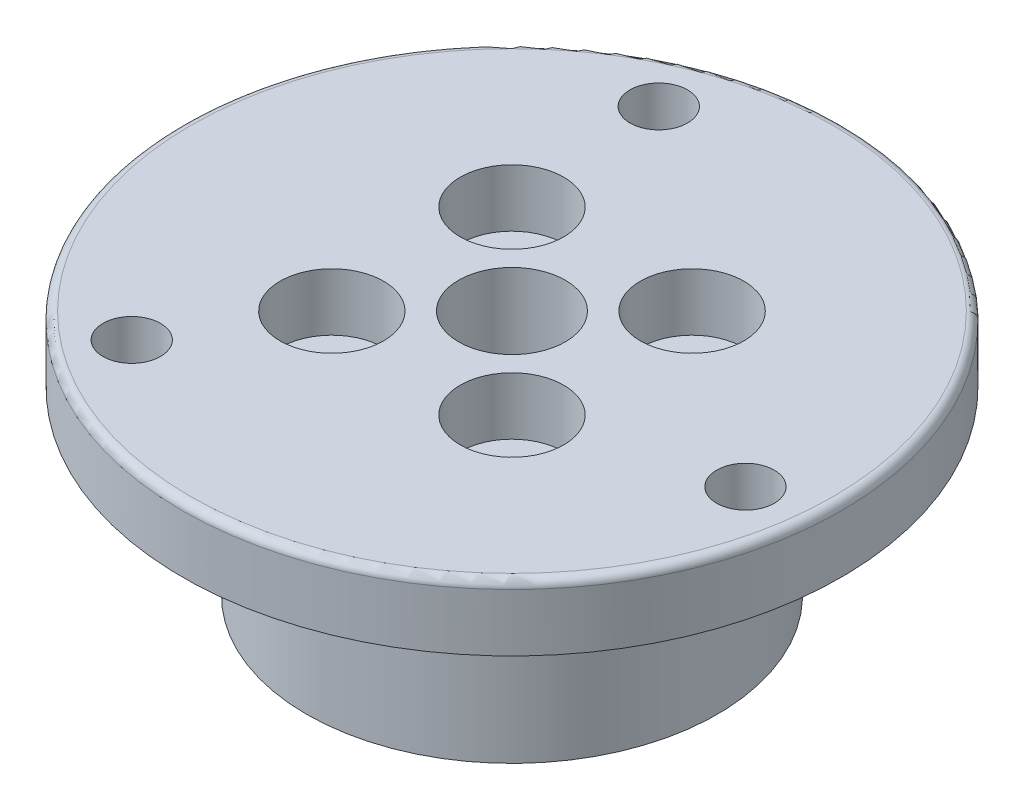
ISO-10303-21;
HEADER;
FILE_DESCRIPTION(('STEP AP214'),'2;1');
FILE_NAME('part.step','',(''),(''),'','','');
FILE_SCHEMA(('AUTOMOTIVE_DESIGN { 1 0 10303 214 1 1 1 1 }'));
ENDSEC;
DATA;
#1=APPLICATION_CONTEXT('core data for automotive mechanical design processes');
#2=APPLICATION_PROTOCOL_DEFINITION('international standard','automotive_design',2000,#1);
#3=PRODUCT_CONTEXT('',#1,'mechanical');
#4=PRODUCT('Part','Part','',(#3));
#5=PRODUCT_RELATED_PRODUCT_CATEGORY('part','',(#4));
#6=PRODUCT_DEFINITION_FORMATION('','',#4);
#7=PRODUCT_DEFINITION_CONTEXT('part definition',#1,'design');
#8=PRODUCT_DEFINITION('design','',#6,#7);
#9=PRODUCT_DEFINITION_SHAPE('','',#8);
#10=(LENGTH_UNIT() NAMED_UNIT(*) SI_UNIT(.MILLI.,.METRE.));
#11=(NAMED_UNIT(*) PLANE_ANGLE_UNIT() SI_UNIT($,.RADIAN.));
#12=(NAMED_UNIT(*) SI_UNIT($,.STERADIAN.) SOLID_ANGLE_UNIT());
#13=UNCERTAINTY_MEASURE_WITH_UNIT(LENGTH_MEASURE(1.E-05),#10,'distance_accuracy_value','');
#14=(GEOMETRIC_REPRESENTATION_CONTEXT(3) GLOBAL_UNCERTAINTY_ASSIGNED_CONTEXT((#13)) GLOBAL_UNIT_ASSIGNED_CONTEXT((#10,
#11,#12)) REPRESENTATION_CONTEXT('',''));
#15=CARTESIAN_POINT('',(0.,0.,0.));
#16=DIRECTION('',(0.,0.,1.));
#17=DIRECTION('',(1.,0.,0.));
#18=AXIS2_PLACEMENT_3D('',#15,#16,#17);
#19=CARTESIAN_POINT('',(16.3588402126679,15.,2.15368217163084));
#20=DIRECTION('',(0.,-1.,0.));
#21=DIRECTION('',(0.,0.,-1.));
#22=AXIS2_PLACEMENT_3D('',#19,#20,#21);
#23=CYLINDRICAL_SURFACE('',#22,1.75);
#24=CARTESIAN_POINT('',(16.3588402126679,15.,2.15368217163084));
#25=DIRECTION('',(0.,1.,0.));
#26=DIRECTION('',(0.,0.,1.));
#27=AXIS2_PLACEMENT_3D('',#24,#25,#26);
#28=CIRCLE('',#27,1.75);
#29=CARTESIAN_POINT('',(16.3588402126679,15.,3.90368217163084));
#30=VERTEX_POINT('',#29);
#31=EDGE_CURVE('E58',#30,#30,#28,.T.);
#32=ORIENTED_EDGE('',*,*,#31,.T.);
#33=EDGE_LOOP('',(#32));
#34=FACE_BOUND('',#33,.T.);
#35=CARTESIAN_POINT('',(16.3588402126679,11.,2.15368217163084));
#36=DIRECTION('',(0.,-1.,0.));
#37=DIRECTION('',(0.,0.,-1.));
#38=AXIS2_PLACEMENT_3D('',#35,#36,#37);
#39=CIRCLE('',#38,1.75);
#40=CARTESIAN_POINT('',(16.3588402126679,11.,0.403682171630836));
#41=VERTEX_POINT('',#40);
#42=EDGE_CURVE('E111',#41,#41,#39,.T.);
#43=ORIENTED_EDGE('',*,*,#42,.T.);
#44=EDGE_LOOP('',(#43));
#45=FACE_BOUND('',#44,.T.);
#46=ADVANCED_FACE('F47',(#34,#45),#23,.F.);
#47=CARTESIAN_POINT('',(-6.314276634024,15.,-15.2440122864362));
#48=DIRECTION('',(0.,-1.,0.));
#49=DIRECTION('',(0.,0.,-1.));
#50=AXIS2_PLACEMENT_3D('',#47,#48,#49);
#51=CYLINDRICAL_SURFACE('',#50,1.75);
#52=CARTESIAN_POINT('',(-6.314276634024,15.,-15.2440122864362));
#53=DIRECTION('',(0.,1.,0.));
#54=DIRECTION('',(0.,0.,1.));
#55=AXIS2_PLACEMENT_3D('',#52,#53,#54);
#56=CIRCLE('',#55,1.75);
#57=CARTESIAN_POINT('',(-6.314276634024,15.,-13.4940122864362));
#58=VERTEX_POINT('',#57);
#59=EDGE_CURVE('E62',#58,#58,#56,.T.);
#60=ORIENTED_EDGE('',*,*,#59,.T.);
#61=EDGE_LOOP('',(#60));
#62=FACE_BOUND('',#61,.T.);
#63=CARTESIAN_POINT('',(-6.314276634024,11.,-15.2440122864362));
#64=DIRECTION('',(0.,-1.,0.));
#65=DIRECTION('',(0.,0.,-1.));
#66=AXIS2_PLACEMENT_3D('',#63,#64,#65);
#67=CIRCLE('',#66,1.75);
#68=CARTESIAN_POINT('',(-6.314276634024,11.,-16.9940122864362));
#69=VERTEX_POINT('',#68);
#70=EDGE_CURVE('E127',#69,#69,#67,.T.);
#71=ORIENTED_EDGE('',*,*,#70,.T.);
#72=EDGE_LOOP('',(#71));
#73=FACE_BOUND('',#72,.T.);
#74=ADVANCED_FACE('F166',(#62,#73),#51,.F.);
#75=CARTESIAN_POINT('',(-10.0445635786439,15.,13.0903301148054));
#76=DIRECTION('',(0.,-1.,0.));
#77=DIRECTION('',(0.,0.,-1.));
#78=AXIS2_PLACEMENT_3D('',#75,#76,#77);
#79=CYLINDRICAL_SURFACE('',#78,1.75);
#80=CARTESIAN_POINT('',(-10.0445635786439,15.,13.0903301148054));
#81=DIRECTION('',(0.,1.,0.));
#82=DIRECTION('',(0.,0.,1.));
#83=AXIS2_PLACEMENT_3D('',#80,#81,#82);
#84=CIRCLE('',#83,1.75);
#85=CARTESIAN_POINT('',(-10.0445635786439,15.,14.8403301148054));
#86=VERTEX_POINT('',#85);
#87=EDGE_CURVE('E96',#86,#86,#84,.T.);
#88=ORIENTED_EDGE('',*,*,#87,.T.);
#89=EDGE_LOOP('',(#88));
#90=FACE_BOUND('',#89,.T.);
#91=CARTESIAN_POINT('',(-10.0445635786439,11.,13.0903301148054));
#92=DIRECTION('',(0.,-1.,0.));
#93=DIRECTION('',(0.,0.,-1.));
#94=AXIS2_PLACEMENT_3D('',#91,#92,#93);
#95=CIRCLE('',#94,1.75);
#96=CARTESIAN_POINT('',(-10.0445635786439,11.,11.3403301148054));
#97=VERTEX_POINT('',#96);
#98=EDGE_CURVE('E130',#97,#97,#95,.T.);
#99=ORIENTED_EDGE('',*,*,#98,.T.);
#100=EDGE_LOOP('',(#99));
#101=FACE_BOUND('',#100,.T.);
#102=ADVANCED_FACE('F157',(#90,#101),#79,.F.);
#103=CARTESIAN_POINT('',(0.,15.,0.));
#104=DIRECTION('',(0.,-1.,0.));
#105=DIRECTION('',(0.,0.,-1.));
#106=AXIS2_PLACEMENT_3D('',#103,#104,#105);
#107=CYLINDRICAL_SURFACE('',#106,20.05);
#108=CARTESIAN_POINT('',(0.,14.5,0.));
#109=DIRECTION('',(0.,1.,0.));
#110=DIRECTION('',(0.,0.,1.));
#111=AXIS2_PLACEMENT_3D('',#108,#109,#110);
#112=CIRCLE('',#111,20.05);
#113=CARTESIAN_POINT('',(0.,14.5,20.05));
#114=VERTEX_POINT('',#113);
#115=EDGE_CURVE('E12',#114,#114,#112,.F.);
#116=ORIENTED_EDGE('',*,*,#115,.T.);
#117=EDGE_LOOP('',(#116));
#118=FACE_BOUND('',#117,.T.);
#119=CARTESIAN_POINT('',(0.,11.,0.));
#120=DIRECTION('',(0.,-1.,0.));
#121=DIRECTION('',(0.,0.,-1.));
#122=AXIS2_PLACEMENT_3D('',#119,#120,#121);
#123=CIRCLE('',#122,20.05);
#124=CARTESIAN_POINT('',(0.,11.,-20.05));
#125=VERTEX_POINT('',#124);
#126=EDGE_CURVE('E133',#125,#125,#123,.T.);
#127=ORIENTED_EDGE('',*,*,#126,.F.);
#128=EDGE_LOOP('',(#127));
#129=FACE_BOUND('',#128,.T.);
#130=ADVANCED_FACE('F154',(#118,#129),#107,.T.);
#131=CARTESIAN_POINT('',(0.,0.,0.));
#132=DIRECTION('',(0.,1.,0.));
#133=DIRECTION('',(0.,0.,1.));
#134=AXIS2_PLACEMENT_3D('',#131,#132,#133);
#135=PLANE('',#134);
#136=CARTESIAN_POINT('',(-5.48007755419575,0.,-5.48007755419574));
#137=DIRECTION('',(0.,1.,0.));
#138=DIRECTION('',(0.,0.,1.));
#139=AXIS2_PLACEMENT_3D('',#136,#137,#138);
#140=CIRCLE('',#139,1.75);
#141=CARTESIAN_POINT('',(-5.48007755419575,0.,-3.73007755419574));
#142=VERTEX_POINT('',#141);
#143=EDGE_CURVE('E79',#142,#142,#140,.T.);
#144=ORIENTED_EDGE('',*,*,#143,.T.);
#145=EDGE_LOOP('',(#144));
#146=FACE_BOUND('',#145,.T.);
#147=CARTESIAN_POINT('',(-5.48007755419574,0.,5.48007755419574));
#148=DIRECTION('',(0.,1.,0.));
#149=DIRECTION('',(0.,0.,1.));
#150=AXIS2_PLACEMENT_3D('',#147,#148,#149);
#151=CIRCLE('',#150,1.75);
#152=CARTESIAN_POINT('',(-5.48007755419574,0.,7.23007755419574));
#153=VERTEX_POINT('',#152);
#154=EDGE_CURVE('E83',#153,#153,#151,.T.);
#155=ORIENTED_EDGE('',*,*,#154,.T.);
#156=EDGE_LOOP('',(#155));
#157=FACE_BOUND('',#156,.T.);
#158=CARTESIAN_POINT('',(5.48007755419575,0.,5.48007755419575));
#159=DIRECTION('',(0.,1.,0.));
#160=DIRECTION('',(0.,0.,1.));
#161=AXIS2_PLACEMENT_3D('',#158,#159,#160);
#162=CIRCLE('',#161,1.75);
#163=CARTESIAN_POINT('',(5.48007755419575,0.,7.23007755419575));
#164=VERTEX_POINT('',#163);
#165=EDGE_CURVE('E86',#164,#164,#162,.T.);
#166=ORIENTED_EDGE('',*,*,#165,.T.);
#167=EDGE_LOOP('',(#166));
#168=FACE_BOUND('',#167,.T.);
#169=CARTESIAN_POINT('',(5.48007755419575,0.,-5.48007755419574));
#170=DIRECTION('',(0.,1.,0.));
#171=DIRECTION('',(0.,0.,1.));
#172=AXIS2_PLACEMENT_3D('',#169,#170,#171);
#173=CIRCLE('',#172,1.75);
#174=CARTESIAN_POINT('',(5.48007755419575,0.,-3.73007755419574));
#175=VERTEX_POINT('',#174);
#176=EDGE_CURVE('E89',#175,#175,#173,.T.);
#177=ORIENTED_EDGE('',*,*,#176,.T.);
#178=EDGE_LOOP('',(#177));
#179=FACE_BOUND('',#178,.T.);
#180=CARTESIAN_POINT('',(0.,0.,0.));
#181=DIRECTION('',(0.,1.,0.));
#182=DIRECTION('',(0.,0.,1.));
#183=AXIS2_PLACEMENT_3D('',#180,#181,#182);
#184=CIRCLE('',#183,3.25);
#185=CARTESIAN_POINT('',(0.,0.,3.25));
#186=VERTEX_POINT('',#185);
#187=EDGE_CURVE('E68',#186,#186,#184,.T.);
#188=ORIENTED_EDGE('',*,*,#187,.T.);
#189=EDGE_LOOP('',(#188));
#190=FACE_BOUND('',#189,.T.);
#191=CARTESIAN_POINT('',(0.,0.,0.));
#192=DIRECTION('',(0.,-1.,0.));
#193=DIRECTION('',(0.,0.,-1.));
#194=AXIS2_PLACEMENT_3D('',#191,#192,#193);
#195=CIRCLE('',#194,12.5);
#196=CARTESIAN_POINT('',(0.,0.,-12.5));
#197=VERTEX_POINT('',#196);
#198=EDGE_CURVE('E137',#197,#197,#195,.T.);
#199=ORIENTED_EDGE('',*,*,#198,.T.);
#200=EDGE_LOOP('',(#199));
#201=FACE_BOUND('',#200,.T.);
#202=ADVANCED_FACE('F156',(#146,#157,#168,#179,#190,#201),#135,.F.);
#203=CARTESIAN_POINT('',(-5.48007755419575,15.,-5.48007755419574));
#204=DIRECTION('',(0.,-1.,0.));
#205=DIRECTION('',(0.,0.,-1.));
#206=AXIS2_PLACEMENT_3D('',#203,#204,#205);
#207=CYLINDRICAL_SURFACE('',#206,1.75);
#208=ORIENTED_EDGE('',*,*,#143,.F.);
#209=EDGE_LOOP('',(#208));
#210=FACE_BOUND('',#209,.T.);
#211=CARTESIAN_POINT('',(-5.48007755419575,11.5,-5.48007755419574));
#212=DIRECTION('',(0.,1.,0.));
#213=DIRECTION('',(0.,0.,1.));
#214=AXIS2_PLACEMENT_3D('',#211,#212,#213);
#215=CIRCLE('',#214,1.75);
#216=CARTESIAN_POINT('',(-5.48007755419575,11.5,-3.73007755419574));
#217=VERTEX_POINT('',#216);
#218=EDGE_CURVE('E65',#217,#217,#215,.T.);
#219=ORIENTED_EDGE('',*,*,#218,.T.);
#220=EDGE_LOOP('',(#219));
#221=FACE_BOUND('',#220,.T.);
#222=ADVANCED_FACE('F163',(#210,#221),#207,.F.);
#223=CARTESIAN_POINT('',(-5.48007755419574,15.,5.48007755419574));
#224=DIRECTION('',(0.,-1.,0.));
#225=DIRECTION('',(0.,0.,-1.));
#226=AXIS2_PLACEMENT_3D('',#223,#224,#225);
#227=CYLINDRICAL_SURFACE('',#226,1.75);
#228=ORIENTED_EDGE('',*,*,#154,.F.);
#229=EDGE_LOOP('',(#228));
#230=FACE_BOUND('',#229,.T.);
#231=CARTESIAN_POINT('',(-5.48007755419574,11.5,5.48007755419574));
#232=DIRECTION('',(0.,1.,0.));
#233=DIRECTION('',(0.,0.,1.));
#234=AXIS2_PLACEMENT_3D('',#231,#232,#233);
#235=CIRCLE('',#234,1.75);
#236=CARTESIAN_POINT('',(-5.48007755419574,11.5,7.23007755419574));
#237=VERTEX_POINT('',#236);
#238=EDGE_CURVE('E69',#237,#237,#235,.T.);
#239=ORIENTED_EDGE('',*,*,#238,.T.);
#240=EDGE_LOOP('',(#239));
#241=FACE_BOUND('',#240,.T.);
#242=ADVANCED_FACE('F181',(#230,#241),#227,.F.);
#243=CARTESIAN_POINT('',(5.48007755419575,15.,5.48007755419575));
#244=DIRECTION('',(0.,-1.,0.));
#245=DIRECTION('',(0.,0.,-1.));
#246=AXIS2_PLACEMENT_3D('',#243,#244,#245);
#247=CYLINDRICAL_SURFACE('',#246,1.75);
#248=ORIENTED_EDGE('',*,*,#165,.F.);
#249=EDGE_LOOP('',(#248));
#250=FACE_BOUND('',#249,.T.);
#251=CARTESIAN_POINT('',(5.48007755419575,11.5,5.48007755419575));
#252=DIRECTION('',(0.,1.,0.));
#253=DIRECTION('',(0.,0.,1.));
#254=AXIS2_PLACEMENT_3D('',#251,#252,#253);
#255=CIRCLE('',#254,1.75);
#256=CARTESIAN_POINT('',(5.48007755419575,11.5,7.23007755419575));
#257=VERTEX_POINT('',#256);
#258=EDGE_CURVE('E72',#257,#257,#255,.T.);
#259=ORIENTED_EDGE('',*,*,#258,.T.);
#260=EDGE_LOOP('',(#259));
#261=FACE_BOUND('',#260,.T.);
#262=ADVANCED_FACE('F185',(#250,#261),#247,.F.);
#263=CARTESIAN_POINT('',(5.48007755419575,15.,-5.48007755419574));
#264=DIRECTION('',(0.,-1.,0.));
#265=DIRECTION('',(0.,0.,-1.));
#266=AXIS2_PLACEMENT_3D('',#263,#264,#265);
#267=CYLINDRICAL_SURFACE('',#266,1.75);
#268=ORIENTED_EDGE('',*,*,#176,.F.);
#269=EDGE_LOOP('',(#268));
#270=FACE_BOUND('',#269,.T.);
#271=CARTESIAN_POINT('',(5.48007755419575,11.5,-5.48007755419574));
#272=DIRECTION('',(0.,1.,0.));
#273=DIRECTION('',(0.,0.,1.));
#274=AXIS2_PLACEMENT_3D('',#271,#272,#273);
#275=CIRCLE('',#274,1.75);
#276=CARTESIAN_POINT('',(5.48007755419575,11.5,-3.73007755419574));
#277=VERTEX_POINT('',#276);
#278=EDGE_CURVE('E75',#277,#277,#275,.T.);
#279=ORIENTED_EDGE('',*,*,#278,.T.);
#280=EDGE_LOOP('',(#279));
#281=FACE_BOUND('',#280,.T.);
#282=ADVANCED_FACE('F189',(#270,#281),#267,.F.);
#283=CARTESIAN_POINT('',(0.,15.,0.));
#284=DIRECTION('',(0.,-1.,0.));
#285=DIRECTION('',(0.,0.,-1.));
#286=AXIS2_PLACEMENT_3D('',#283,#284,#285);
#287=CYLINDRICAL_SURFACE('',#286,3.25);
#288=CARTESIAN_POINT('',(0.,15.,0.));
#289=DIRECTION('',(0.,1.,0.));
#290=DIRECTION('',(0.,0.,1.));
#291=AXIS2_PLACEMENT_3D('',#288,#289,#290);
#292=CIRCLE('',#291,3.25);
#293=CARTESIAN_POINT('',(0.,15.,3.25));
#294=VERTEX_POINT('',#293);
#295=EDGE_CURVE('E82',#294,#294,#292,.T.);
#296=ORIENTED_EDGE('',*,*,#295,.T.);
#297=EDGE_LOOP('',(#296));
#298=FACE_BOUND('',#297,.T.);
#299=ORIENTED_EDGE('',*,*,#187,.F.);
#300=EDGE_LOOP('',(#299));
#301=FACE_BOUND('',#300,.T.);
#302=ADVANCED_FACE('F192',(#298,#301),#287,.F.);
#303=CARTESIAN_POINT('',(0.,15.,0.));
#304=DIRECTION('',(0.,1.,0.));
#305=DIRECTION('',(0.,0.,1.));
#306=AXIS2_PLACEMENT_3D('',#303,#304,#305);
#307=PLANE('',#306);
#308=CARTESIAN_POINT('',(0.,15.,0.));
#309=DIRECTION('',(0.,1.,0.));
#310=DIRECTION('',(0.,0.,1.));
#311=AXIS2_PLACEMENT_3D('',#308,#309,#310);
#312=CIRCLE('',#311,19.55);
#313=CARTESIAN_POINT('',(0.,15.,19.55));
#314=VERTEX_POINT('',#313);
#315=EDGE_CURVE('E54',#314,#314,#312,.T.);
#316=ORIENTED_EDGE('',*,*,#315,.T.);
#317=EDGE_LOOP('',(#316));
#318=FACE_BOUND('',#317,.T.);
#319=CARTESIAN_POINT('',(-5.48007755419574,15.,5.48007755419574));
#320=DIRECTION('',(0.,1.,0.));
#321=DIRECTION('',(0.,0.,1.));
#322=AXIS2_PLACEMENT_3D('',#319,#320,#321);
#323=CIRCLE('',#322,3.15);
#324=CARTESIAN_POINT('',(-5.48007755419574,15.,8.63007755419575));
#325=VERTEX_POINT('',#324);
#326=EDGE_CURVE('E107',#325,#325,#323,.T.);
#327=ORIENTED_EDGE('',*,*,#326,.F.);
#328=EDGE_LOOP('',(#327));
#329=FACE_BOUND('',#328,.T.);
#330=CARTESIAN_POINT('',(5.48007755419575,15.,5.48007755419575));
#331=DIRECTION('',(0.,1.,0.));
#332=DIRECTION('',(0.,0.,1.));
#333=AXIS2_PLACEMENT_3D('',#330,#331,#332);
#334=CIRCLE('',#333,3.15);
#335=CARTESIAN_POINT('',(5.48007755419575,15.,8.63007755419575));
#336=VERTEX_POINT('',#335);
#337=EDGE_CURVE('E114',#336,#336,#334,.T.);
#338=ORIENTED_EDGE('',*,*,#337,.F.);
#339=EDGE_LOOP('',(#338));
#340=FACE_BOUND('',#339,.T.);
#341=CARTESIAN_POINT('',(5.48007755419575,15.,-5.48007755419574));
#342=DIRECTION('',(0.,1.,0.));
#343=DIRECTION('',(0.,0.,1.));
#344=AXIS2_PLACEMENT_3D('',#341,#342,#343);
#345=CIRCLE('',#344,3.15);
#346=CARTESIAN_POINT('',(5.48007755419575,15.,-2.33007755419575));
#347=VERTEX_POINT('',#346);
#348=EDGE_CURVE('E120',#347,#347,#345,.T.);
#349=ORIENTED_EDGE('',*,*,#348,.F.);
#350=EDGE_LOOP('',(#349));
#351=FACE_BOUND('',#350,.T.);
#352=CARTESIAN_POINT('',(-5.48007755419575,15.,-5.48007755419574));
#353=DIRECTION('',(0.,1.,0.));
#354=DIRECTION('',(0.,0.,1.));
#355=AXIS2_PLACEMENT_3D('',#352,#353,#354);
#356=CIRCLE('',#355,3.15);
#357=CARTESIAN_POINT('',(-5.48007755419575,15.,-2.33007755419574));
#358=VERTEX_POINT('',#357);
#359=EDGE_CURVE('E101',#358,#358,#356,.T.);
#360=ORIENTED_EDGE('',*,*,#359,.F.);
#361=EDGE_LOOP('',(#360));
#362=FACE_BOUND('',#361,.T.);
#363=ORIENTED_EDGE('',*,*,#295,.F.);
#364=EDGE_LOOP('',(#363));
#365=FACE_BOUND('',#364,.T.);
#366=ORIENTED_EDGE('',*,*,#87,.F.);
#367=EDGE_LOOP('',(#366));
#368=FACE_BOUND('',#367,.T.);
#369=ORIENTED_EDGE('',*,*,#59,.F.);
#370=EDGE_LOOP('',(#369));
#371=FACE_BOUND('',#370,.T.);
#372=ORIENTED_EDGE('',*,*,#31,.F.);
#373=EDGE_LOOP('',(#372));
#374=FACE_BOUND('',#373,.T.);
#375=ADVANCED_FACE('F195',(#318,#329,#340,#351,#362,#365,#368,#371,#374),#307,.T.);
#376=CARTESIAN_POINT('',(-5.48007755419575,11.5,-5.48007755419574));
#377=DIRECTION('',(0.,1.,0.));
#378=DIRECTION('',(0.,0.,1.));
#379=AXIS2_PLACEMENT_3D('',#376,#377,#378);
#380=CYLINDRICAL_SURFACE('',#379,3.15);
#381=CARTESIAN_POINT('',(-5.48007755419575,11.5,-5.48007755419574));
#382=DIRECTION('',(0.,1.,0.));
#383=DIRECTION('',(0.,0.,1.));
#384=AXIS2_PLACEMENT_3D('',#381,#382,#383);
#385=CIRCLE('',#384,3.15);
#386=CARTESIAN_POINT('',(-5.48007755419575,11.5,-2.33007755419574));
#387=VERTEX_POINT('',#386);
#388=EDGE_CURVE('E78',#387,#387,#385,.T.);
#389=ORIENTED_EDGE('',*,*,#388,.F.);
#390=EDGE_LOOP('',(#389));
#391=FACE_BOUND('',#390,.T.);
#392=ORIENTED_EDGE('',*,*,#359,.T.);
#393=EDGE_LOOP('',(#392));
#394=FACE_BOUND('',#393,.T.);
#395=ADVANCED_FACE('F200',(#391,#394),#380,.F.);
#396=CARTESIAN_POINT('',(-5.48007755419575,11.5,-5.48007755419574));
#397=DIRECTION('',(0.,1.,0.));
#398=DIRECTION('',(0.,0.,1.));
#399=AXIS2_PLACEMENT_3D('',#396,#397,#398);
#400=PLANE('',#399);
#401=ORIENTED_EDGE('',*,*,#218,.F.);
#402=EDGE_LOOP('',(#401));
#403=FACE_BOUND('',#402,.T.);
#404=ORIENTED_EDGE('',*,*,#388,.T.);
#405=EDGE_LOOP('',(#404));
#406=FACE_BOUND('',#405,.T.);
#407=ADVANCED_FACE('F223',(#403,#406),#400,.T.);
#408=CARTESIAN_POINT('',(5.48007755419575,11.5,-5.48007755419574));
#409=DIRECTION('',(0.,1.,0.));
#410=DIRECTION('',(0.,0.,1.));
#411=AXIS2_PLACEMENT_3D('',#408,#409,#410);
#412=CYLINDRICAL_SURFACE('',#411,3.15);
#413=CARTESIAN_POINT('',(5.48007755419575,11.5,-5.48007755419574));
#414=DIRECTION('',(0.,1.,0.));
#415=DIRECTION('',(0.,0.,1.));
#416=AXIS2_PLACEMENT_3D('',#413,#414,#415);
#417=CIRCLE('',#416,3.15);
#418=CARTESIAN_POINT('',(5.48007755419575,11.5,-2.33007755419575));
#419=VERTEX_POINT('',#418);
#420=EDGE_CURVE('E104',#419,#419,#417,.T.);
#421=ORIENTED_EDGE('',*,*,#420,.F.);
#422=EDGE_LOOP('',(#421));
#423=FACE_BOUND('',#422,.T.);
#424=ORIENTED_EDGE('',*,*,#348,.T.);
#425=EDGE_LOOP('',(#424));
#426=FACE_BOUND('',#425,.T.);
#427=ADVANCED_FACE('F219',(#423,#426),#412,.F.);
#428=CARTESIAN_POINT('',(5.48007755419575,11.5,-5.48007755419574));
#429=DIRECTION('',(0.,1.,0.));
#430=DIRECTION('',(0.,0.,1.));
#431=AXIS2_PLACEMENT_3D('',#428,#429,#430);
#432=PLANE('',#431);
#433=ORIENTED_EDGE('',*,*,#278,.F.);
#434=EDGE_LOOP('',(#433));
#435=FACE_BOUND('',#434,.T.);
#436=ORIENTED_EDGE('',*,*,#420,.T.);
#437=EDGE_LOOP('',(#436));
#438=FACE_BOUND('',#437,.T.);
#439=ADVANCED_FACE('F215',(#435,#438),#432,.T.);
#440=CARTESIAN_POINT('',(5.48007755419575,11.5,5.48007755419575));
#441=DIRECTION('',(0.,1.,0.));
#442=DIRECTION('',(0.,0.,1.));
#443=AXIS2_PLACEMENT_3D('',#440,#441,#442);
#444=CYLINDRICAL_SURFACE('',#443,3.15);
#445=CARTESIAN_POINT('',(5.48007755419575,11.5,5.48007755419575));
#446=DIRECTION('',(0.,1.,0.));
#447=DIRECTION('',(0.,0.,1.));
#448=AXIS2_PLACEMENT_3D('',#445,#446,#447);
#449=CIRCLE('',#448,3.15);
#450=CARTESIAN_POINT('',(5.48007755419575,11.5,8.63007755419575));
#451=VERTEX_POINT('',#450);
#452=EDGE_CURVE('E117',#451,#451,#449,.T.);
#453=ORIENTED_EDGE('',*,*,#452,.F.);
#454=EDGE_LOOP('',(#453));
#455=FACE_BOUND('',#454,.T.);
#456=ORIENTED_EDGE('',*,*,#337,.T.);
#457=EDGE_LOOP('',(#456));
#458=FACE_BOUND('',#457,.T.);
#459=ADVANCED_FACE('F218',(#455,#458),#444,.F.);
#460=CARTESIAN_POINT('',(5.48007755419575,11.5,5.48007755419575));
#461=DIRECTION('',(0.,1.,0.));
#462=DIRECTION('',(0.,0.,1.));
#463=AXIS2_PLACEMENT_3D('',#460,#461,#462);
#464=PLANE('',#463);
#465=ORIENTED_EDGE('',*,*,#258,.F.);
#466=EDGE_LOOP('',(#465));
#467=FACE_BOUND('',#466,.T.);
#468=ORIENTED_EDGE('',*,*,#452,.T.);
#469=EDGE_LOOP('',(#468));
#470=FACE_BOUND('',#469,.T.);
#471=ADVANCED_FACE('F225',(#467,#470),#464,.T.);
#472=CARTESIAN_POINT('',(-5.48007755419574,11.5,5.48007755419574));
#473=DIRECTION('',(0.,1.,0.));
#474=DIRECTION('',(0.,0.,1.));
#475=AXIS2_PLACEMENT_3D('',#472,#473,#474);
#476=CYLINDRICAL_SURFACE('',#475,3.15);
#477=CARTESIAN_POINT('',(-5.48007755419574,11.5,5.48007755419574));
#478=DIRECTION('',(0.,1.,0.));
#479=DIRECTION('',(0.,0.,1.));
#480=AXIS2_PLACEMENT_3D('',#477,#478,#479);
#481=CIRCLE('',#480,3.15);
#482=CARTESIAN_POINT('',(-5.48007755419574,11.5,8.63007755419575));
#483=VERTEX_POINT('',#482);
#484=EDGE_CURVE('E110',#483,#483,#481,.T.);
#485=ORIENTED_EDGE('',*,*,#484,.F.);
#486=EDGE_LOOP('',(#485));
#487=FACE_BOUND('',#486,.T.);
#488=ORIENTED_EDGE('',*,*,#326,.T.);
#489=EDGE_LOOP('',(#488));
#490=FACE_BOUND('',#489,.T.);
#491=ADVANCED_FACE('F228',(#487,#490),#476,.F.);
#492=CARTESIAN_POINT('',(-5.48007755419574,11.5,5.48007755419574));
#493=DIRECTION('',(0.,1.,0.));
#494=DIRECTION('',(0.,0.,1.));
#495=AXIS2_PLACEMENT_3D('',#492,#493,#494);
#496=PLANE('',#495);
#497=ORIENTED_EDGE('',*,*,#238,.F.);
#498=EDGE_LOOP('',(#497));
#499=FACE_BOUND('',#498,.T.);
#500=ORIENTED_EDGE('',*,*,#484,.T.);
#501=EDGE_LOOP('',(#500));
#502=FACE_BOUND('',#501,.T.);
#503=ADVANCED_FACE('F149',(#499,#502),#496,.T.);
#504=CARTESIAN_POINT('',(0.,11.,0.));
#505=DIRECTION('',(0.,-1.,0.));
#506=DIRECTION('',(0.,0.,-1.));
#507=AXIS2_PLACEMENT_3D('',#504,#505,#506);
#508=PLANE('',#507);
#509=ORIENTED_EDGE('',*,*,#42,.F.);
#510=EDGE_LOOP('',(#509));
#511=FACE_BOUND('',#510,.T.);
#512=ORIENTED_EDGE('',*,*,#70,.F.);
#513=EDGE_LOOP('',(#512));
#514=FACE_BOUND('',#513,.T.);
#515=ORIENTED_EDGE('',*,*,#98,.F.);
#516=EDGE_LOOP('',(#515));
#517=FACE_BOUND('',#516,.T.);
#518=CARTESIAN_POINT('',(0.,11.,0.));
#519=DIRECTION('',(0.,-1.,0.));
#520=DIRECTION('',(0.,0.,-1.));
#521=AXIS2_PLACEMENT_3D('',#518,#519,#520);
#522=CIRCLE('',#521,12.5);
#523=CARTESIAN_POINT('',(0.,11.,-12.5));
#524=VERTEX_POINT('',#523);
#525=EDGE_CURVE('E136',#524,#524,#522,.T.);
#526=ORIENTED_EDGE('',*,*,#525,.F.);
#527=EDGE_LOOP('',(#526));
#528=FACE_BOUND('',#527,.T.);
#529=ORIENTED_EDGE('',*,*,#126,.T.);
#530=EDGE_LOOP('',(#529));
#531=FACE_BOUND('',#530,.T.);
#532=ADVANCED_FACE('F146',(#511,#514,#517,#528,#531),#508,.T.);
#533=CARTESIAN_POINT('',(0.,11.,0.));
#534=DIRECTION('',(0.,-1.,0.));
#535=DIRECTION('',(0.,0.,-1.));
#536=AXIS2_PLACEMENT_3D('',#533,#534,#535);
#537=CYLINDRICAL_SURFACE('',#536,12.5);
#538=ORIENTED_EDGE('',*,*,#525,.T.);
#539=EDGE_LOOP('',(#538));
#540=FACE_BOUND('',#539,.T.);
#541=ORIENTED_EDGE('',*,*,#198,.F.);
#542=EDGE_LOOP('',(#541));
#543=FACE_BOUND('',#542,.T.);
#544=ADVANCED_FACE('F143',(#540,#543),#537,.T.);
#545=CARTESIAN_POINT('',(0.,14.5,0.));
#546=DIRECTION('',(0.,1.,0.));
#547=DIRECTION('',(0.,0.,1.));
#548=AXIS2_PLACEMENT_3D('',#545,#546,#547);
#549=TOROIDAL_SURFACE('',#548,19.55,0.5);
#550=ORIENTED_EDGE('',*,*,#115,.F.);
#551=EDGE_LOOP('',(#550));
#552=FACE_BOUND('',#551,.T.);
#553=ORIENTED_EDGE('',*,*,#315,.F.);
#554=EDGE_LOOP('',(#553));
#555=FACE_BOUND('',#554,.T.);
#556=ADVANCED_FACE('F49',(#552,#555),#549,.T.);
#557=CLOSED_SHELL('',(#46,#74,#102,#130,#202,#222,#242,#262,#282,#302,#375,#395,#407,#427,#439,
#459,#471,#491,#503,#532,#544,#556));
#558=MANIFOLD_SOLID_BREP('B2',#557);
#559=ADVANCED_BREP_SHAPE_REPRESENTATION('',(#18,#558),#14);
#560=SHAPE_DEFINITION_REPRESENTATION(#9,#559);
ENDSEC;
END-ISO-10303-21;
